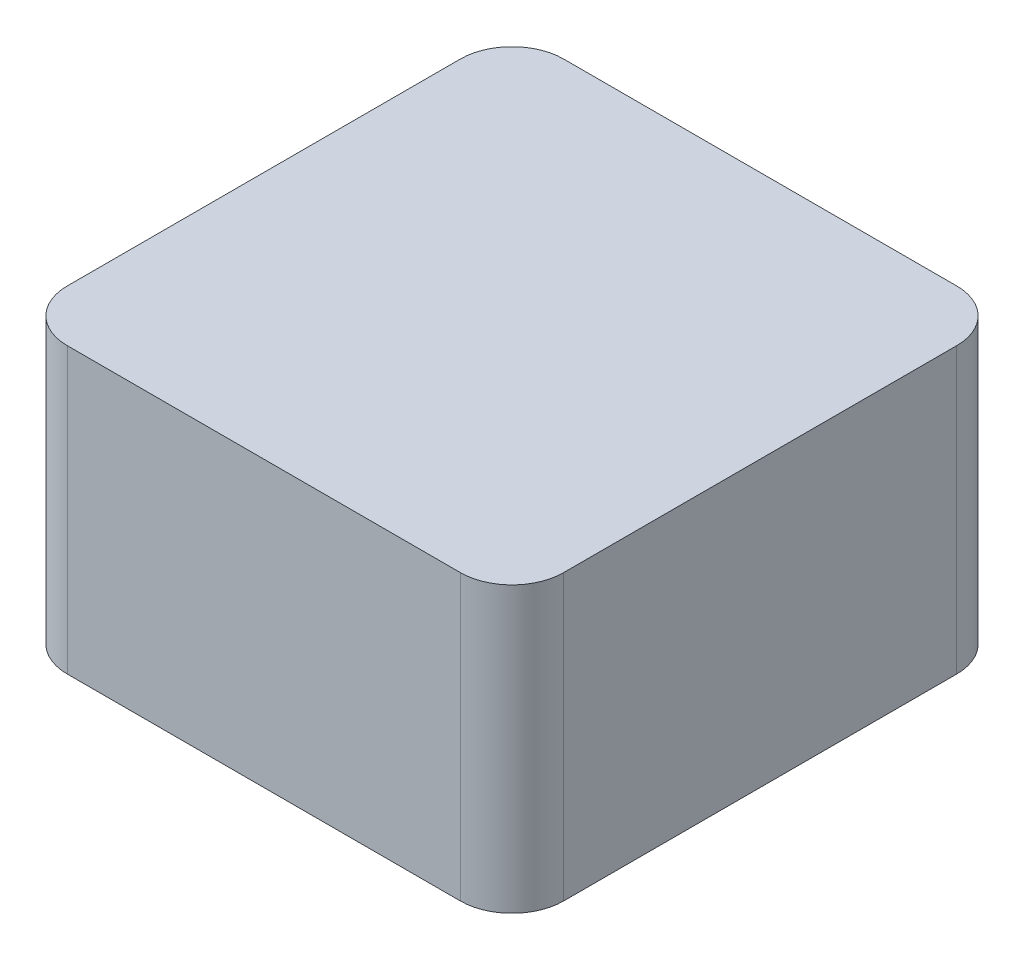
ISO-10303-21;
HEADER;
FILE_DESCRIPTION(('STEP AP214'),'2;1');
FILE_NAME('part.step','',(''),(''),'','','');
FILE_SCHEMA(('AUTOMOTIVE_DESIGN { 1 0 10303 214 1 1 1 1 }'));
ENDSEC;
DATA;
#1=APPLICATION_CONTEXT('core data for automotive mechanical design processes');
#2=APPLICATION_PROTOCOL_DEFINITION('international standard','automotive_design',2000,#1);
#3=PRODUCT_CONTEXT('',#1,'mechanical');
#4=PRODUCT('Part','Part','',(#3));
#5=PRODUCT_RELATED_PRODUCT_CATEGORY('part','',(#4));
#6=PRODUCT_DEFINITION_FORMATION('','',#4);
#7=PRODUCT_DEFINITION_CONTEXT('part definition',#1,'design');
#8=PRODUCT_DEFINITION('design','',#6,#7);
#9=PRODUCT_DEFINITION_SHAPE('','',#8);
#10=(LENGTH_UNIT() NAMED_UNIT(*) SI_UNIT(.MILLI.,.METRE.));
#11=(NAMED_UNIT(*) PLANE_ANGLE_UNIT() SI_UNIT($,.RADIAN.));
#12=(NAMED_UNIT(*) SI_UNIT($,.STERADIAN.) SOLID_ANGLE_UNIT());
#13=UNCERTAINTY_MEASURE_WITH_UNIT(LENGTH_MEASURE(1.E-05),#10,'distance_accuracy_value','');
#14=(GEOMETRIC_REPRESENTATION_CONTEXT(3) GLOBAL_UNCERTAINTY_ASSIGNED_CONTEXT((#13)) GLOBAL_UNIT_ASSIGNED_CONTEXT((#10,
#11,#12)) REPRESENTATION_CONTEXT('',''));
#15=CARTESIAN_POINT('',(0.,0.,0.));
#16=DIRECTION('',(0.,0.,1.));
#17=DIRECTION('',(1.,0.,0.));
#18=AXIS2_PLACEMENT_3D('',#15,#16,#17);
#19=CARTESIAN_POINT('',(-9.48525676253284,22.,-9.95655339805826));
#20=DIRECTION('',(1.,0.,0.));
#21=DIRECTION('',(0.,0.,-1.));
#22=AXIS2_PLACEMENT_3D('',#19,#20,#21);
#23=PLANE('',#22);
#24=DIRECTION('',(0.,0.,1.));
#25=VECTOR('',#24,1.);
#26=CARTESIAN_POINT('',(-9.48525676253284,22.,-9.95655339805826));
#27=LINE('',#26,#25);
#28=CARTESIAN_POINT('',(-9.48525676253284,22.,-5.95655339805826));
#29=VERTEX_POINT('',#28);
#30=CARTESIAN_POINT('',(-9.48525676253284,22.,24.4434466019417));
#31=VERTEX_POINT('',#30);
#32=EDGE_CURVE('E118',#29,#31,#27,.T.);
#33=ORIENTED_EDGE('',*,*,#32,.F.);
#34=DIRECTION('',(0.,-1.,0.));
#35=VECTOR('',#34,1.);
#36=CARTESIAN_POINT('',(-9.48525676253284,22.,-5.95655339805826));
#37=LINE('',#36,#35);
#38=CARTESIAN_POINT('',(-9.48525676253284,0.,-5.95655339805826));
#39=VERTEX_POINT('',#38);
#40=EDGE_CURVE('E103',#29,#39,#37,.T.);
#41=ORIENTED_EDGE('',*,*,#40,.T.);
#42=DIRECTION('',(0.,0.,1.));
#43=VECTOR('',#42,1.);
#44=CARTESIAN_POINT('',(-9.48525676253284,0.,-9.95655339805826));
#45=LINE('',#44,#43);
#46=CARTESIAN_POINT('',(-9.48525676253284,0.,24.4434466019417));
#47=VERTEX_POINT('',#46);
#48=EDGE_CURVE('E115',#39,#47,#45,.T.);
#49=ORIENTED_EDGE('',*,*,#48,.T.);
#50=DIRECTION('',(0.,-1.,0.));
#51=VECTOR('',#50,1.);
#52=CARTESIAN_POINT('',(-9.48525676253284,22.,24.4434466019417));
#53=LINE('',#52,#51);
#54=EDGE_CURVE('E120',#47,#31,#53,.F.);
#55=ORIENTED_EDGE('',*,*,#54,.T.);
#56=EDGE_LOOP('',(#33,#41,#49,#55));
#57=FACE_BOUND('',#56,.T.);
#58=ADVANCED_FACE('F33',(#57),#23,.F.);
#59=CARTESIAN_POINT('',(-9.48525676253284,22.,28.4434466019417));
#60=DIRECTION('',(0.,0.,-1.));
#61=DIRECTION('',(-1.,0.,0.));
#62=AXIS2_PLACEMENT_3D('',#59,#60,#61);
#63=PLANE('',#62);
#64=DIRECTION('',(1.,0.,0.));
#65=VECTOR('',#64,1.);
#66=CARTESIAN_POINT('',(-9.48525676253284,0.,28.4434466019417));
#67=LINE('',#66,#65);
#68=CARTESIAN_POINT('',(-5.48525676253284,0.,28.4434466019417));
#69=VERTEX_POINT('',#68);
#70=CARTESIAN_POINT('',(24.9147432374672,0.,28.4434466019417));
#71=VERTEX_POINT('',#70);
#72=EDGE_CURVE('E124',#69,#71,#67,.T.);
#73=ORIENTED_EDGE('',*,*,#72,.T.);
#74=DIRECTION('',(0.,-1.,0.));
#75=VECTOR('',#74,1.);
#76=CARTESIAN_POINT('',(24.9147432374672,22.,28.4434466019417));
#77=LINE('',#76,#75);
#78=CARTESIAN_POINT('',(24.9147432374672,22.,28.4434466019417));
#79=VERTEX_POINT('',#78);
#80=EDGE_CURVE('E11',#71,#79,#77,.F.);
#81=ORIENTED_EDGE('',*,*,#80,.T.);
#82=DIRECTION('',(1.,0.,0.));
#83=VECTOR('',#82,1.);
#84=CARTESIAN_POINT('',(-9.48525676253284,22.,28.4434466019417));
#85=LINE('',#84,#83);
#86=CARTESIAN_POINT('',(-5.48525676253284,22.,28.4434466019417));
#87=VERTEX_POINT('',#86);
#88=EDGE_CURVE('E160',#87,#79,#85,.T.);
#89=ORIENTED_EDGE('',*,*,#88,.F.);
#90=DIRECTION('',(0.,-1.,0.));
#91=VECTOR('',#90,1.);
#92=CARTESIAN_POINT('',(-5.48525676253284,22.,28.4434466019417));
#93=LINE('',#92,#91);
#94=EDGE_CURVE('E41',#87,#69,#93,.T.);
#95=ORIENTED_EDGE('',*,*,#94,.T.);
#96=EDGE_LOOP('',(#73,#81,#89,#95));
#97=FACE_BOUND('',#96,.T.);
#98=ADVANCED_FACE('F158',(#97),#63,.F.);
#99=CARTESIAN_POINT('',(28.9147432374672,22.,-9.95655339805826));
#100=DIRECTION('',(-1.,0.,0.));
#101=DIRECTION('',(0.,0.,1.));
#102=AXIS2_PLACEMENT_3D('',#99,#100,#101);
#103=PLANE('',#102);
#104=DIRECTION('',(0.,0.,-1.));
#105=VECTOR('',#104,1.);
#106=CARTESIAN_POINT('',(28.9147432374672,0.,-9.95655339805826));
#107=LINE('',#106,#105);
#108=CARTESIAN_POINT('',(28.9147432374672,0.,24.4434466019417));
#109=VERTEX_POINT('',#108);
#110=CARTESIAN_POINT('',(28.9147432374672,0.,-5.95655339805826));
#111=VERTEX_POINT('',#110);
#112=EDGE_CURVE('E127',#109,#111,#107,.T.);
#113=ORIENTED_EDGE('',*,*,#112,.T.);
#114=DIRECTION('',(0.,-1.,0.));
#115=VECTOR('',#114,1.);
#116=CARTESIAN_POINT('',(28.9147432374672,22.,-5.95655339805826));
#117=LINE('',#116,#115);
#118=CARTESIAN_POINT('',(28.9147432374672,22.,-5.95655339805826));
#119=VERTEX_POINT('',#118);
#120=EDGE_CURVE('E48',#111,#119,#117,.F.);
#121=ORIENTED_EDGE('',*,*,#120,.T.);
#122=DIRECTION('',(0.,0.,-1.));
#123=VECTOR('',#122,1.);
#124=CARTESIAN_POINT('',(28.9147432374672,22.,-9.95655339805826));
#125=LINE('',#124,#123);
#126=CARTESIAN_POINT('',(28.9147432374672,22.,24.4434466019417));
#127=VERTEX_POINT('',#126);
#128=EDGE_CURVE('E168',#127,#119,#125,.T.);
#129=ORIENTED_EDGE('',*,*,#128,.F.);
#130=DIRECTION('',(0.,-1.,0.));
#131=VECTOR('',#130,1.);
#132=CARTESIAN_POINT('',(28.9147432374672,22.,24.4434466019417));
#133=LINE('',#132,#131);
#134=EDGE_CURVE('E151',#127,#109,#133,.T.);
#135=ORIENTED_EDGE('',*,*,#134,.T.);
#136=EDGE_LOOP('',(#113,#121,#129,#135));
#137=FACE_BOUND('',#136,.T.);
#138=ADVANCED_FACE('F167',(#137),#103,.F.);
#139=CARTESIAN_POINT('',(-9.48525676253284,22.,-9.95655339805826));
#140=DIRECTION('',(0.,0.,1.));
#141=DIRECTION('',(1.,0.,0.));
#142=AXIS2_PLACEMENT_3D('',#139,#140,#141);
#143=PLANE('',#142);
#144=DIRECTION('',(-1.,0.,0.));
#145=VECTOR('',#144,1.);
#146=CARTESIAN_POINT('',(-9.48525676253284,0.,-9.95655339805826));
#147=LINE('',#146,#145);
#148=CARTESIAN_POINT('',(24.9147432374672,0.,-9.95655339805826));
#149=VERTEX_POINT('',#148);
#150=CARTESIAN_POINT('',(-5.48525676253284,0.,-9.95655339805826));
#151=VERTEX_POINT('',#150);
#152=EDGE_CURVE('E134',#149,#151,#147,.T.);
#153=ORIENTED_EDGE('',*,*,#152,.T.);
#154=DIRECTION('',(0.,-1.,0.));
#155=VECTOR('',#154,1.);
#156=CARTESIAN_POINT('',(-5.48525676253284,22.,-9.95655339805826));
#157=LINE('',#156,#155);
#158=CARTESIAN_POINT('',(-5.48525676253284,22.,-9.95655339805826));
#159=VERTEX_POINT('',#158);
#160=EDGE_CURVE('E104',#151,#159,#157,.F.);
#161=ORIENTED_EDGE('',*,*,#160,.T.);
#162=DIRECTION('',(-1.,0.,0.));
#163=VECTOR('',#162,1.);
#164=CARTESIAN_POINT('',(-9.48525676253284,22.,-9.95655339805826));
#165=LINE('',#164,#163);
#166=CARTESIAN_POINT('',(24.9147432374672,22.,-9.95655339805826));
#167=VERTEX_POINT('',#166);
#168=EDGE_CURVE('E130',#167,#159,#165,.T.);
#169=ORIENTED_EDGE('',*,*,#168,.F.);
#170=DIRECTION('',(0.,-1.,0.));
#171=VECTOR('',#170,1.);
#172=CARTESIAN_POINT('',(24.9147432374672,22.,-9.95655339805826));
#173=LINE('',#172,#171);
#174=EDGE_CURVE('E109',#167,#149,#173,.T.);
#175=ORIENTED_EDGE('',*,*,#174,.T.);
#176=EDGE_LOOP('',(#153,#161,#169,#175));
#177=FACE_BOUND('',#176,.T.);
#178=ADVANCED_FACE('F196',(#177),#143,.F.);
#179=CARTESIAN_POINT('',(0.,22.,0.));
#180=DIRECTION('',(0.,1.,0.));
#181=DIRECTION('',(0.,0.,1.));
#182=AXIS2_PLACEMENT_3D('',#179,#180,#181);
#183=PLANE('',#182);
#184=ORIENTED_EDGE('',*,*,#168,.T.);
#185=CARTESIAN_POINT('',(-5.48525676253284,22.,-5.95655339805826));
#186=DIRECTION('',(0.,1.,0.));
#187=DIRECTION('',(0.,0.,1.));
#188=AXIS2_PLACEMENT_3D('',#185,#186,#187);
#189=CIRCLE('',#188,4.);
#190=EDGE_CURVE('E149',#159,#29,#189,.T.);
#191=ORIENTED_EDGE('',*,*,#190,.T.);
#192=ORIENTED_EDGE('',*,*,#32,.T.);
#193=CARTESIAN_POINT('',(-5.48525676253284,22.,24.4434466019417));
#194=DIRECTION('',(0.,1.,0.));
#195=DIRECTION('',(0.,0.,1.));
#196=AXIS2_PLACEMENT_3D('',#193,#194,#195);
#197=CIRCLE('',#196,4.);
#198=EDGE_CURVE('E144',#31,#87,#197,.T.);
#199=ORIENTED_EDGE('',*,*,#198,.T.);
#200=ORIENTED_EDGE('',*,*,#88,.T.);
#201=CARTESIAN_POINT('',(24.9147432374672,22.,24.4434466019417));
#202=DIRECTION('',(0.,1.,0.));
#203=DIRECTION('',(0.,0.,1.));
#204=AXIS2_PLACEMENT_3D('',#201,#202,#203);
#205=CIRCLE('',#204,4.);
#206=EDGE_CURVE('E55',#79,#127,#205,.T.);
#207=ORIENTED_EDGE('',*,*,#206,.T.);
#208=ORIENTED_EDGE('',*,*,#128,.T.);
#209=CARTESIAN_POINT('',(24.9147432374672,22.,-5.95655339805826));
#210=DIRECTION('',(0.,1.,0.));
#211=DIRECTION('',(0.,0.,1.));
#212=AXIS2_PLACEMENT_3D('',#209,#210,#211);
#213=CIRCLE('',#212,4.);
#214=EDGE_CURVE('E147',#119,#167,#213,.T.);
#215=ORIENTED_EDGE('',*,*,#214,.T.);
#216=EDGE_LOOP('',(#184,#191,#192,#199,#200,#207,#208,#215));
#217=FACE_BOUND('',#216,.T.);
#218=ADVANCED_FACE('F173',(#217),#183,.T.);
#219=CARTESIAN_POINT('',(0.,0.,0.));
#220=DIRECTION('',(0.,1.,0.));
#221=DIRECTION('',(0.,0.,1.));
#222=AXIS2_PLACEMENT_3D('',#219,#220,#221);
#223=PLANE('',#222);
#224=ORIENTED_EDGE('',*,*,#48,.F.);
#225=CARTESIAN_POINT('',(-5.48525676253284,0.,-5.95655339805826));
#226=DIRECTION('',(0.,1.,0.));
#227=DIRECTION('',(0.,0.,1.));
#228=AXIS2_PLACEMENT_3D('',#225,#226,#227);
#229=CIRCLE('',#228,4.);
#230=EDGE_CURVE('E99',#39,#151,#229,.F.);
#231=ORIENTED_EDGE('',*,*,#230,.T.);
#232=ORIENTED_EDGE('',*,*,#152,.F.);
#233=CARTESIAN_POINT('',(24.9147432374672,0.,-5.95655339805826));
#234=DIRECTION('',(0.,1.,0.));
#235=DIRECTION('',(0.,0.,1.));
#236=AXIS2_PLACEMENT_3D('',#233,#234,#235);
#237=CIRCLE('',#236,4.);
#238=EDGE_CURVE('E110',#149,#111,#237,.F.);
#239=ORIENTED_EDGE('',*,*,#238,.T.);
#240=ORIENTED_EDGE('',*,*,#112,.F.);
#241=CARTESIAN_POINT('',(24.9147432374672,0.,24.4434466019417));
#242=DIRECTION('',(0.,1.,0.));
#243=DIRECTION('',(0.,0.,1.));
#244=AXIS2_PLACEMENT_3D('',#241,#242,#243);
#245=CIRCLE('',#244,4.);
#246=EDGE_CURVE('E138',#109,#71,#245,.F.);
#247=ORIENTED_EDGE('',*,*,#246,.T.);
#248=ORIENTED_EDGE('',*,*,#72,.F.);
#249=CARTESIAN_POINT('',(-5.48525676253284,0.,24.4434466019417));
#250=DIRECTION('',(0.,1.,0.));
#251=DIRECTION('',(0.,0.,1.));
#252=AXIS2_PLACEMENT_3D('',#249,#250,#251);
#253=CIRCLE('',#252,4.);
#254=EDGE_CURVE('E119',#69,#47,#253,.F.);
#255=ORIENTED_EDGE('',*,*,#254,.T.);
#256=EDGE_LOOP('',(#224,#231,#232,#239,#240,#247,#248,#255));
#257=FACE_BOUND('',#256,.T.);
#258=ADVANCED_FACE('F122',(#257),#223,.F.);
#259=CARTESIAN_POINT('',(-5.48525676253284,22.,-5.95655339805826));
#260=DIRECTION('',(0.,-1.,0.));
#261=DIRECTION('',(0.,0.,-1.));
#262=AXIS2_PLACEMENT_3D('',#259,#260,#261);
#263=CYLINDRICAL_SURFACE('',#262,4.);
#264=ORIENTED_EDGE('',*,*,#190,.F.);
#265=ORIENTED_EDGE('',*,*,#160,.F.);
#266=ORIENTED_EDGE('',*,*,#230,.F.);
#267=ORIENTED_EDGE('',*,*,#40,.F.);
#268=EDGE_LOOP('',(#264,#265,#266,#267));
#269=FACE_BOUND('',#268,.T.);
#270=ADVANCED_FACE('F102',(#269),#263,.T.);
#271=CARTESIAN_POINT('',(24.9147432374672,22.,-5.95655339805826));
#272=DIRECTION('',(0.,-1.,0.));
#273=DIRECTION('',(0.,0.,-1.));
#274=AXIS2_PLACEMENT_3D('',#271,#272,#273);
#275=CYLINDRICAL_SURFACE('',#274,4.);
#276=ORIENTED_EDGE('',*,*,#214,.F.);
#277=ORIENTED_EDGE('',*,*,#120,.F.);
#278=ORIENTED_EDGE('',*,*,#238,.F.);
#279=ORIENTED_EDGE('',*,*,#174,.F.);
#280=EDGE_LOOP('',(#276,#277,#278,#279));
#281=FACE_BOUND('',#280,.T.);
#282=ADVANCED_FACE('F178',(#281),#275,.T.);
#283=CARTESIAN_POINT('',(24.9147432374672,22.,24.4434466019417));
#284=DIRECTION('',(0.,-1.,0.));
#285=DIRECTION('',(0.,0.,-1.));
#286=AXIS2_PLACEMENT_3D('',#283,#284,#285);
#287=CYLINDRICAL_SURFACE('',#286,4.);
#288=ORIENTED_EDGE('',*,*,#206,.F.);
#289=ORIENTED_EDGE('',*,*,#80,.F.);
#290=ORIENTED_EDGE('',*,*,#246,.F.);
#291=ORIENTED_EDGE('',*,*,#134,.F.);
#292=EDGE_LOOP('',(#288,#289,#290,#291));
#293=FACE_BOUND('',#292,.T.);
#294=ADVANCED_FACE('F166',(#293),#287,.T.);
#295=CARTESIAN_POINT('',(-5.48525676253284,22.,24.4434466019417));
#296=DIRECTION('',(0.,-1.,0.));
#297=DIRECTION('',(0.,0.,-1.));
#298=AXIS2_PLACEMENT_3D('',#295,#296,#297);
#299=CYLINDRICAL_SURFACE('',#298,4.);
#300=ORIENTED_EDGE('',*,*,#198,.F.);
#301=ORIENTED_EDGE('',*,*,#54,.F.);
#302=ORIENTED_EDGE('',*,*,#254,.F.);
#303=ORIENTED_EDGE('',*,*,#94,.F.);
#304=EDGE_LOOP('',(#300,#301,#302,#303));
#305=FACE_BOUND('',#304,.T.);
#306=ADVANCED_FACE('F35',(#305),#299,.T.);
#307=CLOSED_SHELL('',(#58,#98,#138,#178,#218,#258,#270,#282,#294,#306));
#308=MANIFOLD_SOLID_BREP('B2',#307);
#309=ADVANCED_BREP_SHAPE_REPRESENTATION('',(#18,#308),#14);
#310=SHAPE_DEFINITION_REPRESENTATION(#9,#309);
ENDSEC;
END-ISO-10303-21;
